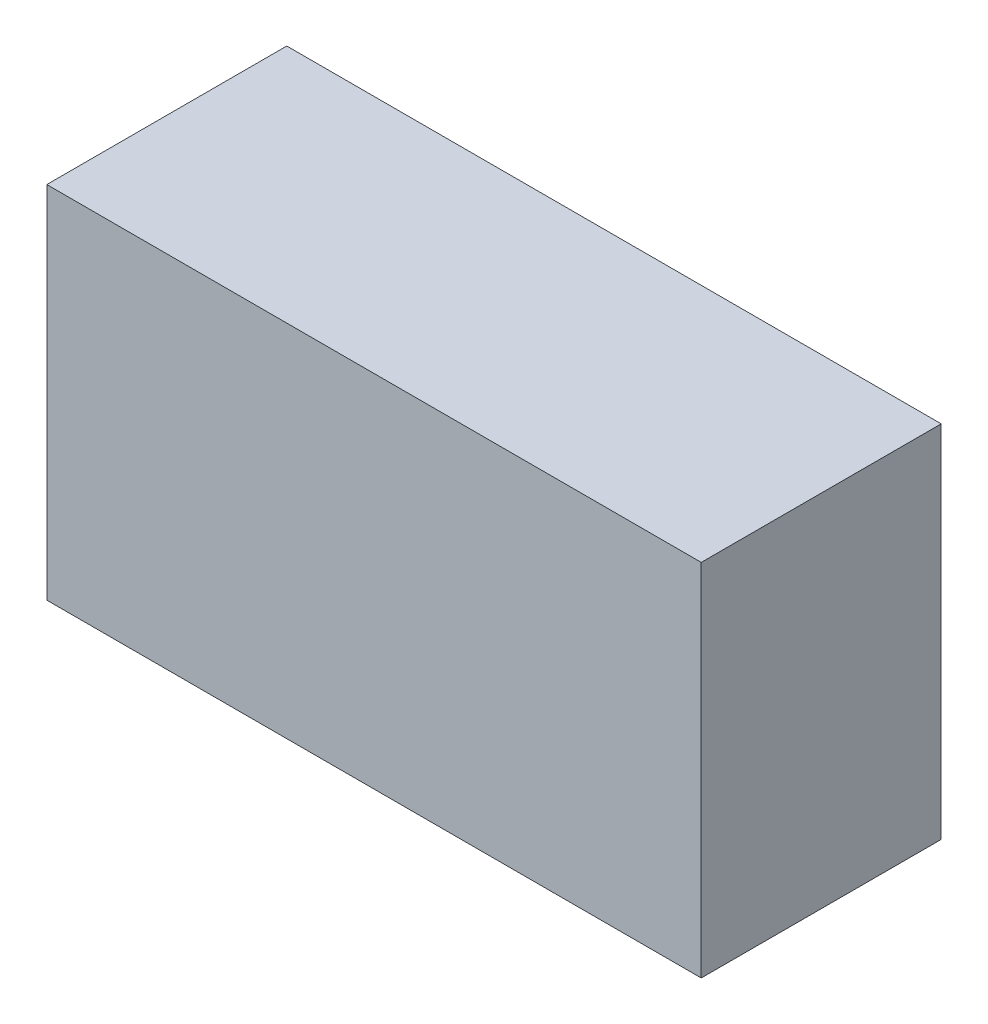
ISO-10303-21;
HEADER;
FILE_DESCRIPTION(('STEP AP214'),'2;1');
FILE_NAME('part.step','',(''),(''),'','','');
FILE_SCHEMA(('AUTOMOTIVE_DESIGN { 1 0 10303 214 1 1 1 1 }'));
ENDSEC;
DATA;
#1=APPLICATION_CONTEXT('core data for automotive mechanical design processes');
#2=APPLICATION_PROTOCOL_DEFINITION('international standard','automotive_design',2000,#1);
#3=PRODUCT_CONTEXT('',#1,'mechanical');
#4=PRODUCT('Part','Part','',(#3));
#5=PRODUCT_RELATED_PRODUCT_CATEGORY('part','',(#4));
#6=PRODUCT_DEFINITION_FORMATION('','',#4);
#7=PRODUCT_DEFINITION_CONTEXT('part definition',#1,'design');
#8=PRODUCT_DEFINITION('design','',#6,#7);
#9=PRODUCT_DEFINITION_SHAPE('','',#8);
#10=(LENGTH_UNIT() NAMED_UNIT(*) SI_UNIT(.MILLI.,.METRE.));
#11=(NAMED_UNIT(*) PLANE_ANGLE_UNIT() SI_UNIT($,.RADIAN.));
#12=(NAMED_UNIT(*) SI_UNIT($,.STERADIAN.) SOLID_ANGLE_UNIT());
#13=UNCERTAINTY_MEASURE_WITH_UNIT(LENGTH_MEASURE(1.E-05),#10,'distance_accuracy_value','');
#14=(GEOMETRIC_REPRESENTATION_CONTEXT(3) GLOBAL_UNCERTAINTY_ASSIGNED_CONTEXT((#13)) GLOBAL_UNIT_ASSIGNED_CONTEXT((#10,
#11,#12)) REPRESENTATION_CONTEXT('',''));
#15=CARTESIAN_POINT('',(0.,0.,0.));
#16=DIRECTION('',(0.,0.,1.));
#17=DIRECTION('',(1.,0.,0.));
#18=AXIS2_PLACEMENT_3D('',#15,#16,#17);
#19=CARTESIAN_POINT('',(-1.49999954,0.82499962,1.10000034));
#20=DIRECTION('',(0.,0.,1.));
#21=DIRECTION('',(1.,0.,0.));
#22=AXIS2_PLACEMENT_3D('',#19,#20,#21);
#23=PLANE('',#22);
#24=DIRECTION('',(0.,1.,0.));
#25=VECTOR('',#24,1.);
#26=CARTESIAN_POINT('',(1.49999954,0.82499962,1.10000034));
#27=LINE('',#26,#25);
#28=CARTESIAN_POINT('',(1.49999954,0.82499962,1.10000034));
#29=VERTEX_POINT('',#28);
#30=CARTESIAN_POINT('',(1.49999954,-0.82499962,1.10000034));
#31=VERTEX_POINT('',#30);
#32=EDGE_CURVE('E53',#29,#31,#27,.F.);
#33=ORIENTED_EDGE('',*,*,#32,.F.);
#34=DIRECTION('',(1.,0.,0.));
#35=VECTOR('',#34,1.);
#36=CARTESIAN_POINT('',(-1.49999954,0.82499962,1.10000034));
#37=LINE('',#36,#35);
#38=CARTESIAN_POINT('',(-1.49999954,0.82499962,1.10000034));
#39=VERTEX_POINT('',#38);
#40=EDGE_CURVE('E68',#39,#29,#37,.T.);
#41=ORIENTED_EDGE('',*,*,#40,.F.);
#42=DIRECTION('',(0.,1.,0.));
#43=VECTOR('',#42,1.);
#44=CARTESIAN_POINT('',(-1.49999954,-0.82499962,1.10000034));
#45=LINE('',#44,#43);
#46=CARTESIAN_POINT('',(-1.49999954,-0.82499962,1.10000034));
#47=VERTEX_POINT('',#46);
#48=EDGE_CURVE('E20',#47,#39,#45,.T.);
#49=ORIENTED_EDGE('',*,*,#48,.F.);
#50=DIRECTION('',(1.,0.,0.));
#51=VECTOR('',#50,1.);
#52=CARTESIAN_POINT('',(1.49999954,-0.82499962,1.10000034));
#53=LINE('',#52,#51);
#54=EDGE_CURVE('E58',#31,#47,#53,.F.);
#55=ORIENTED_EDGE('',*,*,#54,.F.);
#56=EDGE_LOOP('',(#33,#41,#49,#55));
#57=FACE_BOUND('',#56,.T.);
#58=ADVANCED_FACE('F17',(#57),#23,.T.);
#59=CARTESIAN_POINT('',(-1.49999954,-0.82499962,0.));
#60=DIRECTION('',(-1.,0.,0.));
#61=DIRECTION('',(0.,0.,1.));
#62=AXIS2_PLACEMENT_3D('',#59,#60,#61);
#63=PLANE('',#62);
#64=DIRECTION('',(0.,0.,1.));
#65=VECTOR('',#64,1.);
#66=CARTESIAN_POINT('',(-1.49999954,0.82499962,0.));
#67=LINE('',#66,#65);
#68=CARTESIAN_POINT('',(-1.49999954,0.82499962,0.));
#69=VERTEX_POINT('',#68);
#70=EDGE_CURVE('E79',#69,#39,#67,.T.);
#71=ORIENTED_EDGE('',*,*,#70,.F.);
#72=DIRECTION('',(0.,1.,0.));
#73=VECTOR('',#72,1.);
#74=CARTESIAN_POINT('',(-1.49999954,0.82499962,0.));
#75=LINE('',#74,#73);
#76=CARTESIAN_POINT('',(-1.49999954,-0.82499962,0.));
#77=VERTEX_POINT('',#76);
#78=EDGE_CURVE('E74',#69,#77,#75,.F.);
#79=ORIENTED_EDGE('',*,*,#78,.T.);
#80=DIRECTION('',(0.,0.,-1.));
#81=VECTOR('',#80,1.);
#82=CARTESIAN_POINT('',(-1.49999954,-0.82499962,0.));
#83=LINE('',#82,#81);
#84=EDGE_CURVE('E63',#47,#77,#83,.T.);
#85=ORIENTED_EDGE('',*,*,#84,.F.);
#86=ORIENTED_EDGE('',*,*,#48,.T.);
#87=EDGE_LOOP('',(#71,#79,#85,#86));
#88=FACE_BOUND('',#87,.T.);
#89=ADVANCED_FACE('F73',(#88),#63,.T.);
#90=CARTESIAN_POINT('',(1.49999954,-0.82499962,0.));
#91=DIRECTION('',(0.,-1.,0.));
#92=DIRECTION('',(0.,0.,-1.));
#93=AXIS2_PLACEMENT_3D('',#90,#91,#92);
#94=PLANE('',#93);
#95=ORIENTED_EDGE('',*,*,#84,.T.);
#96=DIRECTION('',(1.,0.,0.));
#97=VECTOR('',#96,1.);
#98=CARTESIAN_POINT('',(-1.49999954,-0.82499962,0.));
#99=LINE('',#98,#97);
#100=CARTESIAN_POINT('',(1.49999954,-0.82499962,0.));
#101=VERTEX_POINT('',#100);
#102=EDGE_CURVE('E84',#77,#101,#99,.T.);
#103=ORIENTED_EDGE('',*,*,#102,.T.);
#104=DIRECTION('',(0.,0.,-1.));
#105=VECTOR('',#104,1.);
#106=CARTESIAN_POINT('',(1.49999954,-0.82499962,0.));
#107=LINE('',#106,#105);
#108=EDGE_CURVE('E65',#31,#101,#107,.T.);
#109=ORIENTED_EDGE('',*,*,#108,.F.);
#110=ORIENTED_EDGE('',*,*,#54,.T.);
#111=EDGE_LOOP('',(#95,#103,#109,#110));
#112=FACE_BOUND('',#111,.T.);
#113=ADVANCED_FACE('F60',(#112),#94,.T.);
#114=CARTESIAN_POINT('',(1.49999954,0.82499962,0.));
#115=DIRECTION('',(1.,0.,0.));
#116=DIRECTION('',(0.,0.,-1.));
#117=AXIS2_PLACEMENT_3D('',#114,#115,#116);
#118=PLANE('',#117);
#119=ORIENTED_EDGE('',*,*,#108,.T.);
#120=DIRECTION('',(0.,1.,0.));
#121=VECTOR('',#120,1.);
#122=CARTESIAN_POINT('',(1.49999954,0.82499962,0.));
#123=LINE('',#122,#121);
#124=CARTESIAN_POINT('',(1.49999954,0.82499962,0.));
#125=VERTEX_POINT('',#124);
#126=EDGE_CURVE('E26',#101,#125,#123,.T.);
#127=ORIENTED_EDGE('',*,*,#126,.T.);
#128=DIRECTION('',(0.,0.,1.));
#129=VECTOR('',#128,1.);
#130=CARTESIAN_POINT('',(1.49999954,0.82499962,0.));
#131=LINE('',#130,#129);
#132=EDGE_CURVE('E34',#29,#125,#131,.F.);
#133=ORIENTED_EDGE('',*,*,#132,.F.);
#134=ORIENTED_EDGE('',*,*,#32,.T.);
#135=EDGE_LOOP('',(#119,#127,#133,#134));
#136=FACE_BOUND('',#135,.T.);
#137=ADVANCED_FACE('F88',(#136),#118,.T.);
#138=CARTESIAN_POINT('',(-1.49999954,0.82499962,0.));
#139=DIRECTION('',(0.,1.,0.));
#140=DIRECTION('',(0.,0.,1.));
#141=AXIS2_PLACEMENT_3D('',#138,#139,#140);
#142=PLANE('',#141);
#143=ORIENTED_EDGE('',*,*,#132,.T.);
#144=DIRECTION('',(1.,0.,0.));
#145=VECTOR('',#144,1.);
#146=CARTESIAN_POINT('',(-1.49999954,0.82499962,0.));
#147=LINE('',#146,#145);
#148=EDGE_CURVE('E11',#125,#69,#147,.F.);
#149=ORIENTED_EDGE('',*,*,#148,.T.);
#150=ORIENTED_EDGE('',*,*,#70,.T.);
#151=ORIENTED_EDGE('',*,*,#40,.T.);
#152=EDGE_LOOP('',(#143,#149,#150,#151));
#153=FACE_BOUND('',#152,.T.);
#154=ADVANCED_FACE('F91',(#153),#142,.T.);
#155=CARTESIAN_POINT('',(-1.49999954,0.82499962,0.));
#156=DIRECTION('',(0.,0.,1.));
#157=DIRECTION('',(1.,0.,0.));
#158=AXIS2_PLACEMENT_3D('',#155,#156,#157);
#159=PLANE('',#158);
#160=ORIENTED_EDGE('',*,*,#126,.F.);
#161=ORIENTED_EDGE('',*,*,#102,.F.);
#162=ORIENTED_EDGE('',*,*,#78,.F.);
#163=ORIENTED_EDGE('',*,*,#148,.F.);
#164=EDGE_LOOP('',(#160,#161,#162,#163));
#165=FACE_BOUND('',#164,.T.);
#166=ADVANCED_FACE('F90',(#165),#159,.F.);
#167=CLOSED_SHELL('',(#58,#89,#113,#137,#154,#166));
#168=MANIFOLD_SOLID_BREP('B1',#167);
#169=ADVANCED_BREP_SHAPE_REPRESENTATION('',(#18,#168),#14);
#170=SHAPE_DEFINITION_REPRESENTATION(#9,#169);
ENDSEC;
END-ISO-10303-21;
